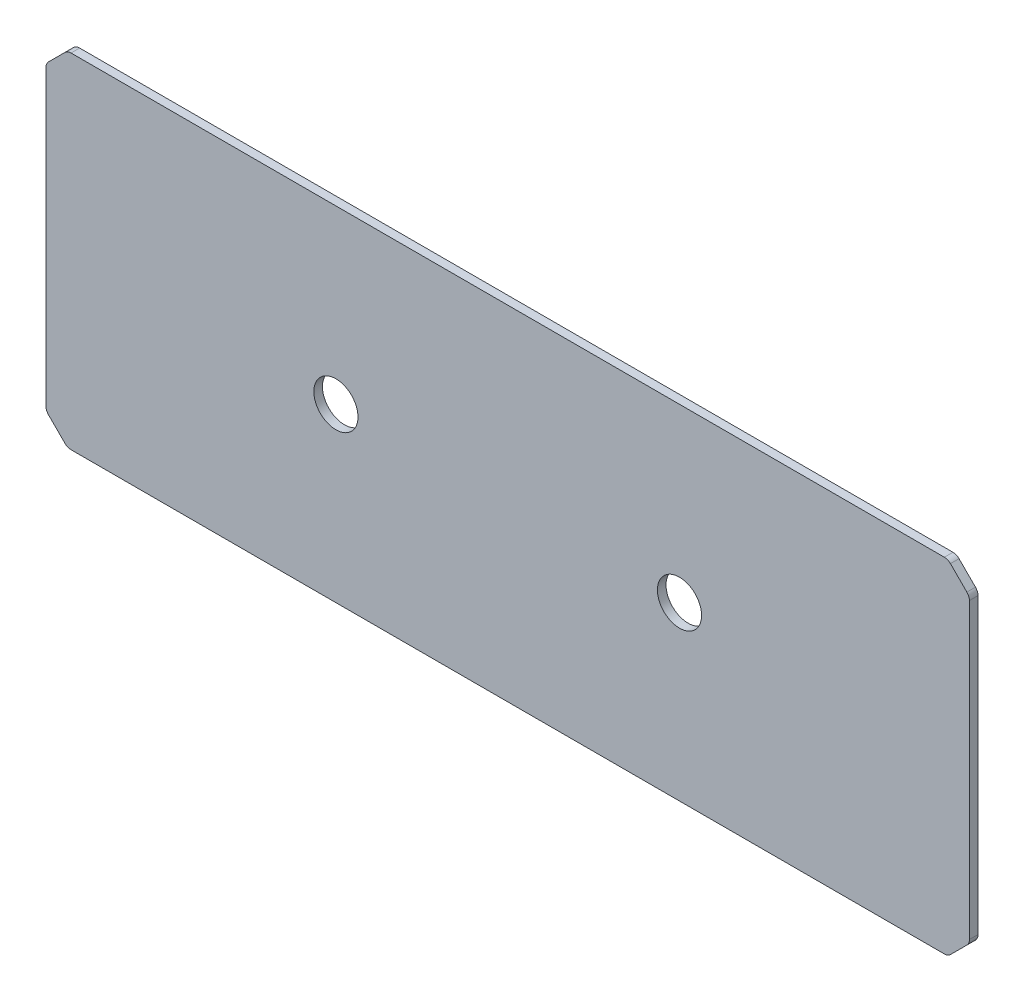
ISO-10303-21;
HEADER;
FILE_DESCRIPTION(('STEP AP214'),'2;1');
FILE_NAME('part.step','',(''),(''),'','','');
FILE_SCHEMA(('AUTOMOTIVE_DESIGN { 1 0 10303 214 1 1 1 1 }'));
ENDSEC;
DATA;
#1=APPLICATION_CONTEXT('core data for automotive mechanical design processes');
#2=APPLICATION_PROTOCOL_DEFINITION('international standard','automotive_design',2000,#1);
#3=PRODUCT_CONTEXT('',#1,'mechanical');
#4=PRODUCT('Part','Part','',(#3));
#5=PRODUCT_RELATED_PRODUCT_CATEGORY('part','',(#4));
#6=PRODUCT_DEFINITION_FORMATION('','',#4);
#7=PRODUCT_DEFINITION_CONTEXT('part definition',#1,'design');
#8=PRODUCT_DEFINITION('design','',#6,#7);
#9=PRODUCT_DEFINITION_SHAPE('','',#8);
#10=(LENGTH_UNIT() NAMED_UNIT(*) SI_UNIT(.MILLI.,.METRE.));
#11=(NAMED_UNIT(*) PLANE_ANGLE_UNIT() SI_UNIT($,.RADIAN.));
#12=(NAMED_UNIT(*) SI_UNIT($,.STERADIAN.) SOLID_ANGLE_UNIT());
#13=UNCERTAINTY_MEASURE_WITH_UNIT(LENGTH_MEASURE(1.E-05),#10,'distance_accuracy_value','');
#14=(GEOMETRIC_REPRESENTATION_CONTEXT(3) GLOBAL_UNCERTAINTY_ASSIGNED_CONTEXT((#13)) GLOBAL_UNIT_ASSIGNED_CONTEXT((#10,
#11,#12)) REPRESENTATION_CONTEXT('',''));
#15=CARTESIAN_POINT('',(0.,0.,0.));
#16=DIRECTION('',(0.,0.,1.));
#17=DIRECTION('',(1.,0.,0.));
#18=AXIS2_PLACEMENT_3D('',#15,#16,#17);
#19=CARTESIAN_POINT('',(0.,-88.046001815833,1.27));
#20=DIRECTION('',(-1.,0.,0.));
#21=DIRECTION('',(0.,0.,1.));
#22=AXIS2_PLACEMENT_3D('',#19,#20,#21);
#23=PLANE('',#22);
#24=DIRECTION('',(0.,1.,0.));
#25=VECTOR('',#24,1.);
#26=CARTESIAN_POINT('',(0.,-88.046001815833,1.27));
#27=LINE('',#26,#25);
#28=CARTESIAN_POINT('',(0.,3.70105122421385,1.27));
#29=VERTEX_POINT('',#28);
#30=CARTESIAN_POINT('',(0.,47.0989487757862,1.27));
#31=VERTEX_POINT('',#30);
#32=EDGE_CURVE('E316',#29,#31,#27,.T.);
#33=ORIENTED_EDGE('',*,*,#32,.T.);
#34=DIRECTION('',(0.,0.,1.));
#35=VECTOR('',#34,1.);
#36=CARTESIAN_POINT('',(0.,47.0989487757862,1.27));
#37=LINE('',#36,#35);
#38=CARTESIAN_POINT('',(0.,47.0989487757862,0.));
#39=VERTEX_POINT('',#38);
#40=EDGE_CURVE('E212',#31,#39,#37,.F.);
#41=ORIENTED_EDGE('',*,*,#40,.T.);
#42=DIRECTION('',(0.,1.,0.));
#43=VECTOR('',#42,1.);
#44=CARTESIAN_POINT('',(0.,-88.046001815833,0.));
#45=LINE('',#44,#43);
#46=CARTESIAN_POINT('',(0.,3.70105122421385,0.));
#47=VERTEX_POINT('',#46);
#48=EDGE_CURVE('E205',#47,#39,#45,.T.);
#49=ORIENTED_EDGE('',*,*,#48,.F.);
#50=DIRECTION('',(0.,0.,1.));
#51=VECTOR('',#50,1.);
#52=CARTESIAN_POINT('',(0.,3.70105122421385,1.27));
#53=LINE('',#52,#51);
#54=EDGE_CURVE('E218',#47,#29,#53,.T.);
#55=ORIENTED_EDGE('',*,*,#54,.T.);
#56=EDGE_LOOP('',(#33,#41,#49,#55));
#57=FACE_BOUND('',#56,.T.);
#58=ADVANCED_FACE('F86',(#57),#23,.T.);
#59=CARTESIAN_POINT('',(68.2625,-88.046001815833,0.));
#60=DIRECTION('',(0.,0.,1.));
#61=DIRECTION('',(1.,0.,0.));
#62=AXIS2_PLACEMENT_3D('',#59,#60,#61);
#63=PLANE('',#62);
#64=CARTESIAN_POINT('',(42.8625,25.4,0.));
#65=DIRECTION('',(0.,0.,1.));
#66=DIRECTION('',(1.,0.,0.));
#67=AXIS2_PLACEMENT_3D('',#64,#65,#66);
#68=CIRCLE('',#67,3.26389999999999);
#69=CARTESIAN_POINT('',(46.1264,25.4,0.));
#70=VERTEX_POINT('',#69);
#71=EDGE_CURVE('E385',#70,#70,#68,.T.);
#72=ORIENTED_EDGE('',*,*,#71,.T.);
#73=EDGE_LOOP('',(#72));
#74=FACE_BOUND('',#73,.T.);
#75=CARTESIAN_POINT('',(93.6625,25.4,0.));
#76=DIRECTION('',(0.,0.,1.));
#77=DIRECTION('',(1.,0.,0.));
#78=AXIS2_PLACEMENT_3D('',#75,#76,#77);
#79=CIRCLE('',#78,3.26389999999998);
#80=CARTESIAN_POINT('',(96.9264,25.4,0.));
#81=VERTEX_POINT('',#80);
#82=EDGE_CURVE('E308',#81,#81,#79,.T.);
#83=ORIENTED_EDGE('',*,*,#82,.T.);
#84=EDGE_LOOP('',(#83));
#85=FACE_BOUND('',#84,.T.);
#86=ORIENTED_EDGE('',*,*,#48,.T.);
#87=CARTESIAN_POINT('',(1.27,47.0989487757862,0.));
#88=DIRECTION('',(0.,0.,1.));
#89=DIRECTION('',(1.,0.,0.));
#90=AXIS2_PLACEMENT_3D('',#87,#88,#89);
#91=CIRCLE('',#90,1.27);
#92=CARTESIAN_POINT('',(0.3719743878931,47.9969743878932,0.));
#93=VERTEX_POINT('',#92);
#94=EDGE_CURVE('E244',#39,#93,#91,.F.);
#95=ORIENTED_EDGE('',*,*,#94,.T.);
#96=DIRECTION('',(-0.707106781186551,-0.707106781186544,0.));
#97=VECTOR('',#96,1.);
#98=CARTESIAN_POINT('',(0.,47.6250000000001,0.));
#99=LINE('',#98,#97);
#100=CARTESIAN_POINT('',(2.80302561210687,50.4280256121069,0.));
#101=VERTEX_POINT('',#100);
#102=EDGE_CURVE('E326',#93,#101,#99,.F.);
#103=ORIENTED_EDGE('',*,*,#102,.T.);
#104=CARTESIAN_POINT('',(3.70105122421378,49.53,0.));
#105=DIRECTION('',(0.,0.,1.));
#106=DIRECTION('',(1.,0.,0.));
#107=AXIS2_PLACEMENT_3D('',#104,#105,#106);
#108=CIRCLE('',#107,1.27);
#109=CARTESIAN_POINT('',(3.70105122421378,50.8,0.));
#110=VERTEX_POINT('',#109);
#111=EDGE_CURVE('E242',#101,#110,#108,.F.);
#112=ORIENTED_EDGE('',*,*,#111,.T.);
#113=DIRECTION('',(1.,0.,0.));
#114=VECTOR('',#113,1.);
#115=CARTESIAN_POINT('',(68.2625,50.8,0.));
#116=LINE('',#115,#114);
#117=CARTESIAN_POINT('',(132.823948775786,50.8,0.));
#118=VERTEX_POINT('',#117);
#119=EDGE_CURVE('E222',#110,#118,#116,.T.);
#120=ORIENTED_EDGE('',*,*,#119,.T.);
#121=CARTESIAN_POINT('',(132.823948775786,49.53,0.));
#122=DIRECTION('',(0.,0.,1.));
#123=DIRECTION('',(1.,0.,0.));
#124=AXIS2_PLACEMENT_3D('',#121,#122,#123);
#125=CIRCLE('',#124,1.27);
#126=CARTESIAN_POINT('',(133.721974387893,50.4280256121069,0.));
#127=VERTEX_POINT('',#126);
#128=EDGE_CURVE('E240',#118,#127,#125,.F.);
#129=ORIENTED_EDGE('',*,*,#128,.T.);
#130=DIRECTION('',(0.707106781186554,-0.707106781186541,0.));
#131=VECTOR('',#130,1.);
#132=CARTESIAN_POINT('',(133.35,50.8,0.));
#133=LINE('',#132,#131);
#134=CARTESIAN_POINT('',(136.153025612107,47.9969743878931,0.));
#135=VERTEX_POINT('',#134);
#136=EDGE_CURVE('E323',#127,#135,#133,.T.);
#137=ORIENTED_EDGE('',*,*,#136,.T.);
#138=CARTESIAN_POINT('',(135.255,47.0989487757862,0.));
#139=DIRECTION('',(0.,0.,1.));
#140=DIRECTION('',(1.,0.,0.));
#141=AXIS2_PLACEMENT_3D('',#138,#139,#140);
#142=CIRCLE('',#141,1.27);
#143=CARTESIAN_POINT('',(136.525,47.0989487757862,0.));
#144=VERTEX_POINT('',#143);
#145=EDGE_CURVE('E238',#135,#144,#142,.F.);
#146=ORIENTED_EDGE('',*,*,#145,.T.);
#147=DIRECTION('',(0.,1.,0.));
#148=VECTOR('',#147,1.);
#149=CARTESIAN_POINT('',(136.525,-88.046001815833,0.));
#150=LINE('',#149,#148);
#151=CARTESIAN_POINT('',(136.525,3.70105122421387,0.));
#152=VERTEX_POINT('',#151);
#153=EDGE_CURVE('E307',#152,#144,#150,.T.);
#154=ORIENTED_EDGE('',*,*,#153,.F.);
#155=CARTESIAN_POINT('',(135.255,3.70105122421387,0.));
#156=DIRECTION('',(0.,0.,1.));
#157=DIRECTION('',(1.,0.,0.));
#158=AXIS2_PLACEMENT_3D('',#155,#156,#157);
#159=CIRCLE('',#158,1.27);
#160=CARTESIAN_POINT('',(136.153025612107,2.80302561210695,0.));
#161=VERTEX_POINT('',#160);
#162=EDGE_CURVE('E236',#152,#161,#159,.F.);
#163=ORIENTED_EDGE('',*,*,#162,.T.);
#164=DIRECTION('',(0.707106781186549,0.707106781186546,0.));
#165=VECTOR('',#164,1.);
#166=CARTESIAN_POINT('',(136.525,3.17500000000003,0.));
#167=LINE('',#166,#165);
#168=CARTESIAN_POINT('',(133.721974387893,0.371974387893075,0.));
#169=VERTEX_POINT('',#168);
#170=EDGE_CURVE('E321',#161,#169,#167,.F.);
#171=ORIENTED_EDGE('',*,*,#170,.T.);
#172=CARTESIAN_POINT('',(132.823948775786,1.27,0.));
#173=DIRECTION('',(0.,0.,1.));
#174=DIRECTION('',(1.,0.,0.));
#175=AXIS2_PLACEMENT_3D('',#172,#173,#174);
#176=CIRCLE('',#175,1.27);
#177=CARTESIAN_POINT('',(132.823948775786,0.,0.));
#178=VERTEX_POINT('',#177);
#179=EDGE_CURVE('E234',#169,#178,#176,.F.);
#180=ORIENTED_EDGE('',*,*,#179,.T.);
#181=DIRECTION('',(1.,0.,0.));
#182=VECTOR('',#181,1.);
#183=CARTESIAN_POINT('',(68.2625,0.,0.));
#184=LINE('',#183,#182);
#185=CARTESIAN_POINT('',(3.70105122421385,0.,0.));
#186=VERTEX_POINT('',#185);
#187=EDGE_CURVE('E303',#186,#178,#184,.T.);
#188=ORIENTED_EDGE('',*,*,#187,.F.);
#189=CARTESIAN_POINT('',(3.70105122421385,1.27,0.));
#190=DIRECTION('',(0.,0.,1.));
#191=DIRECTION('',(1.,0.,0.));
#192=AXIS2_PLACEMENT_3D('',#189,#190,#191);
#193=CIRCLE('',#192,1.27);
#194=CARTESIAN_POINT('',(2.80302561210693,0.371974387893079,0.));
#195=VERTEX_POINT('',#194);
#196=EDGE_CURVE('E211',#186,#195,#193,.F.);
#197=ORIENTED_EDGE('',*,*,#196,.T.);
#198=DIRECTION('',(-0.707106781186548,0.707106781186548,0.));
#199=VECTOR('',#198,1.);
#200=CARTESIAN_POINT('',(3.17500000000001,0.,0.));
#201=LINE('',#200,#199);
#202=CARTESIAN_POINT('',(0.371974387893079,2.80302561210693,0.));
#203=VERTEX_POINT('',#202);
#204=EDGE_CURVE('E207',#195,#203,#201,.T.);
#205=ORIENTED_EDGE('',*,*,#204,.T.);
#206=CARTESIAN_POINT('',(1.27,3.70105122421385,0.));
#207=DIRECTION('',(0.,0.,1.));
#208=DIRECTION('',(1.,0.,0.));
#209=AXIS2_PLACEMENT_3D('',#206,#207,#208);
#210=CIRCLE('',#209,1.27);
#211=EDGE_CURVE('E202',#203,#47,#210,.F.);
#212=ORIENTED_EDGE('',*,*,#211,.T.);
#213=EDGE_LOOP('',(#86,#95,#103,#112,#120,#129,#137,#146,#154,#163,#171,#180,#188,#197,#205,#212));
#214=FACE_BOUND('',#213,.T.);
#215=ADVANCED_FACE('F204',(#74,#85,#214),#63,.F.);
#216=CARTESIAN_POINT('',(68.2625,50.8,1.27));
#217=DIRECTION('',(0.,1.,0.));
#218=DIRECTION('',(0.,0.,1.));
#219=AXIS2_PLACEMENT_3D('',#216,#217,#218);
#220=PLANE('',#219);
#221=ORIENTED_EDGE('',*,*,#119,.F.);
#222=DIRECTION('',(0.,0.,-1.));
#223=VECTOR('',#222,1.);
#224=CARTESIAN_POINT('',(3.70105122421378,50.8,1.27));
#225=LINE('',#224,#223);
#226=CARTESIAN_POINT('',(3.70105122421378,50.8,1.27));
#227=VERTEX_POINT('',#226);
#228=EDGE_CURVE('E266',#110,#227,#225,.F.);
#229=ORIENTED_EDGE('',*,*,#228,.T.);
#230=DIRECTION('',(1.,0.,0.));
#231=VECTOR('',#230,1.);
#232=CARTESIAN_POINT('',(68.2625,50.8,1.27));
#233=LINE('',#232,#231);
#234=CARTESIAN_POINT('',(132.823948775786,50.8,1.27));
#235=VERTEX_POINT('',#234);
#236=EDGE_CURVE('E348',#227,#235,#233,.T.);
#237=ORIENTED_EDGE('',*,*,#236,.T.);
#238=DIRECTION('',(0.,0.,-1.));
#239=VECTOR('',#238,1.);
#240=CARTESIAN_POINT('',(132.823948775786,50.8,1.27));
#241=LINE('',#240,#239);
#242=EDGE_CURVE('E263',#235,#118,#241,.T.);
#243=ORIENTED_EDGE('',*,*,#242,.T.);
#244=EDGE_LOOP('',(#221,#229,#237,#243));
#245=FACE_BOUND('',#244,.T.);
#246=ADVANCED_FACE('F346',(#245),#220,.T.);
#247=CARTESIAN_POINT('',(136.525,-88.046001815833,1.27));
#248=DIRECTION('',(-1.,0.,0.));
#249=DIRECTION('',(0.,0.,1.));
#250=AXIS2_PLACEMENT_3D('',#247,#248,#249);
#251=PLANE('',#250);
#252=ORIENTED_EDGE('',*,*,#153,.T.);
#253=DIRECTION('',(0.,0.,1.));
#254=VECTOR('',#253,1.);
#255=CARTESIAN_POINT('',(136.525,47.0989487757862,1.27));
#256=LINE('',#255,#254);
#257=CARTESIAN_POINT('',(136.525,47.0989487757862,1.27));
#258=VERTEX_POINT('',#257);
#259=EDGE_CURVE('E275',#144,#258,#256,.T.);
#260=ORIENTED_EDGE('',*,*,#259,.T.);
#261=DIRECTION('',(0.,1.,0.));
#262=VECTOR('',#261,1.);
#263=CARTESIAN_POINT('',(136.525,-88.046001815833,1.27));
#264=LINE('',#263,#262);
#265=CARTESIAN_POINT('',(136.525,3.70105122421387,1.27));
#266=VERTEX_POINT('',#265);
#267=EDGE_CURVE('E367',#266,#258,#264,.T.);
#268=ORIENTED_EDGE('',*,*,#267,.F.);
#269=DIRECTION('',(0.,0.,1.));
#270=VECTOR('',#269,1.);
#271=CARTESIAN_POINT('',(136.525,3.70105122421387,0.));
#272=LINE('',#271,#270);
#273=EDGE_CURVE('E272',#266,#152,#272,.F.);
#274=ORIENTED_EDGE('',*,*,#273,.T.);
#275=EDGE_LOOP('',(#252,#260,#268,#274));
#276=FACE_BOUND('',#275,.T.);
#277=ADVANCED_FACE('F363',(#276),#251,.F.);
#278=CARTESIAN_POINT('',(68.2625,0.,1.27));
#279=DIRECTION('',(0.,1.,0.));
#280=DIRECTION('',(0.,0.,1.));
#281=AXIS2_PLACEMENT_3D('',#278,#279,#280);
#282=PLANE('',#281);
#283=ORIENTED_EDGE('',*,*,#187,.T.);
#284=DIRECTION('',(0.,0.,-1.));
#285=VECTOR('',#284,1.);
#286=CARTESIAN_POINT('',(132.823948775786,0.,1.27));
#287=LINE('',#286,#285);
#288=CARTESIAN_POINT('',(132.823948775786,0.,1.27));
#289=VERTEX_POINT('',#288);
#290=EDGE_CURVE('E285',#178,#289,#287,.F.);
#291=ORIENTED_EDGE('',*,*,#290,.T.);
#292=DIRECTION('',(1.,0.,0.));
#293=VECTOR('',#292,1.);
#294=CARTESIAN_POINT('',(68.2625,0.,1.27));
#295=LINE('',#294,#293);
#296=CARTESIAN_POINT('',(3.70105122421385,0.,1.27));
#297=VERTEX_POINT('',#296);
#298=EDGE_CURVE('E221',#297,#289,#295,.T.);
#299=ORIENTED_EDGE('',*,*,#298,.F.);
#300=DIRECTION('',(0.,0.,-1.));
#301=VECTOR('',#300,1.);
#302=CARTESIAN_POINT('',(3.70105122421385,0.,0.));
#303=LINE('',#302,#301);
#304=EDGE_CURVE('E282',#297,#186,#303,.T.);
#305=ORIENTED_EDGE('',*,*,#304,.T.);
#306=EDGE_LOOP('',(#283,#291,#299,#305));
#307=FACE_BOUND('',#306,.T.);
#308=ADVANCED_FACE('F302',(#307),#282,.F.);
#309=CARTESIAN_POINT('',(68.2625,-88.046001815833,1.27));
#310=DIRECTION('',(0.,0.,1.));
#311=DIRECTION('',(1.,0.,0.));
#312=AXIS2_PLACEMENT_3D('',#309,#310,#311);
#313=PLANE('',#312);
#314=CARTESIAN_POINT('',(42.8625,25.4,1.27));
#315=DIRECTION('',(0.,0.,1.));
#316=DIRECTION('',(1.,0.,0.));
#317=AXIS2_PLACEMENT_3D('',#314,#315,#316);
#318=CIRCLE('',#317,3.26389999999999);
#319=CARTESIAN_POINT('',(46.1264,25.4,1.27));
#320=VERTEX_POINT('',#319);
#321=EDGE_CURVE('E383',#320,#320,#318,.T.);
#322=ORIENTED_EDGE('',*,*,#321,.F.);
#323=EDGE_LOOP('',(#322));
#324=FACE_BOUND('',#323,.T.);
#325=CARTESIAN_POINT('',(93.6625,25.4,1.27));
#326=DIRECTION('',(0.,0.,1.));
#327=DIRECTION('',(1.,0.,0.));
#328=AXIS2_PLACEMENT_3D('',#325,#326,#327);
#329=CIRCLE('',#328,3.26389999999998);
#330=CARTESIAN_POINT('',(96.9264,25.4,1.27));
#331=VERTEX_POINT('',#330);
#332=EDGE_CURVE('E313',#331,#331,#329,.T.);
#333=ORIENTED_EDGE('',*,*,#332,.F.);
#334=EDGE_LOOP('',(#333));
#335=FACE_BOUND('',#334,.T.);
#336=DIRECTION('',(0.707106781186551,0.707106781186544,0.));
#337=VECTOR('',#336,1.);
#338=CARTESIAN_POINT('',(-33.7042509079162,13.9207490920841,1.27));
#339=LINE('',#338,#337);
#340=CARTESIAN_POINT('',(2.80302561210686,50.4280256121069,1.27));
#341=VERTEX_POINT('',#340);
#342=CARTESIAN_POINT('',(0.371974387893083,47.9969743878932,1.27));
#343=VERTEX_POINT('',#342);
#344=EDGE_CURVE('E229',#341,#343,#339,.F.);
#345=ORIENTED_EDGE('',*,*,#344,.T.);
#346=CARTESIAN_POINT('',(1.27,47.0989487757862,1.27));
#347=DIRECTION('',(0.,0.,1.));
#348=DIRECTION('',(1.,0.,0.));
#349=AXIS2_PLACEMENT_3D('',#346,#347,#348);
#350=CIRCLE('',#349,1.27);
#351=EDGE_CURVE('E261',#343,#31,#350,.T.);
#352=ORIENTED_EDGE('',*,*,#351,.T.);
#353=ORIENTED_EDGE('',*,*,#32,.F.);
#354=CARTESIAN_POINT('',(1.27,3.70105122421385,1.27));
#355=DIRECTION('',(0.,0.,1.));
#356=DIRECTION('',(1.,0.,0.));
#357=AXIS2_PLACEMENT_3D('',#354,#355,#356);
#358=CIRCLE('',#357,1.27);
#359=CARTESIAN_POINT('',(0.371974387893062,2.80302561210694,1.27));
#360=VERTEX_POINT('',#359);
#361=EDGE_CURVE('E224',#29,#360,#358,.T.);
#362=ORIENTED_EDGE('',*,*,#361,.T.);
#363=DIRECTION('',(0.707106781186548,-0.707106781186548,0.));
#364=VECTOR('',#363,1.);
#365=CARTESIAN_POINT('',(79.7417509079165,-76.5667509079165,1.27));
#366=LINE('',#365,#364);
#367=CARTESIAN_POINT('',(2.80302561210691,0.37197438789309,1.27));
#368=VERTEX_POINT('',#367);
#369=EDGE_CURVE('E225',#360,#368,#366,.T.);
#370=ORIENTED_EDGE('',*,*,#369,.T.);
#371=CARTESIAN_POINT('',(3.70105122421385,1.27,1.27));
#372=DIRECTION('',(0.,0.,1.));
#373=DIRECTION('',(1.,0.,0.));
#374=AXIS2_PLACEMENT_3D('',#371,#372,#373);
#375=CIRCLE('',#374,1.27);
#376=EDGE_CURVE('E251',#368,#297,#375,.T.);
#377=ORIENTED_EDGE('',*,*,#376,.T.);
#378=ORIENTED_EDGE('',*,*,#298,.T.);
#379=CARTESIAN_POINT('',(132.823948775786,1.27,1.27));
#380=DIRECTION('',(0.,0.,1.));
#381=DIRECTION('',(1.,0.,0.));
#382=AXIS2_PLACEMENT_3D('',#379,#380,#381);
#383=CIRCLE('',#382,1.27);
#384=CARTESIAN_POINT('',(133.721974387893,0.371974387893076,1.27));
#385=VERTEX_POINT('',#384);
#386=EDGE_CURVE('E253',#289,#385,#383,.T.);
#387=ORIENTED_EDGE('',*,*,#386,.T.);
#388=DIRECTION('',(-0.707106781186549,-0.707106781186546,0.));
#389=VECTOR('',#388,1.);
#390=CARTESIAN_POINT('',(56.7832490920833,-76.5667509079163,1.27));
#391=LINE('',#390,#389);
#392=CARTESIAN_POINT('',(136.153025612107,2.80302561210695,1.27));
#393=VERTEX_POINT('',#392);
#394=EDGE_CURVE('E330',#385,#393,#391,.F.);
#395=ORIENTED_EDGE('',*,*,#394,.T.);
#396=CARTESIAN_POINT('',(135.255,3.70105122421387,1.27));
#397=DIRECTION('',(0.,0.,1.));
#398=DIRECTION('',(1.,0.,0.));
#399=AXIS2_PLACEMENT_3D('',#396,#397,#398);
#400=CIRCLE('',#399,1.27);
#401=EDGE_CURVE('E255',#393,#266,#400,.T.);
#402=ORIENTED_EDGE('',*,*,#401,.T.);
#403=ORIENTED_EDGE('',*,*,#267,.T.);
#404=CARTESIAN_POINT('',(135.255,47.0989487757862,1.27));
#405=DIRECTION('',(0.,0.,1.));
#406=DIRECTION('',(1.,0.,0.));
#407=AXIS2_PLACEMENT_3D('',#404,#405,#406);
#408=CIRCLE('',#407,1.27);
#409=CARTESIAN_POINT('',(136.153025612107,47.9969743878931,1.27));
#410=VERTEX_POINT('',#409);
#411=EDGE_CURVE('E257',#258,#410,#408,.T.);
#412=ORIENTED_EDGE('',*,*,#411,.T.);
#413=DIRECTION('',(-0.707106781186554,0.707106781186541,0.));
#414=VECTOR('',#413,1.);
#415=CARTESIAN_POINT('',(170.229250907916,13.9207490920847,1.27));
#416=LINE('',#415,#414);
#417=CARTESIAN_POINT('',(133.721974387893,50.4280256121069,1.27));
#418=VERTEX_POINT('',#417);
#419=EDGE_CURVE('E333',#410,#418,#416,.T.);
#420=ORIENTED_EDGE('',*,*,#419,.T.);
#421=CARTESIAN_POINT('',(132.823948775786,49.53,1.27));
#422=DIRECTION('',(0.,0.,1.));
#423=DIRECTION('',(1.,0.,0.));
#424=AXIS2_PLACEMENT_3D('',#421,#422,#423);
#425=CIRCLE('',#424,1.27);
#426=EDGE_CURVE('E101',#418,#235,#425,.T.);
#427=ORIENTED_EDGE('',*,*,#426,.T.);
#428=ORIENTED_EDGE('',*,*,#236,.F.);
#429=CARTESIAN_POINT('',(3.70105122421378,49.53,1.27));
#430=DIRECTION('',(0.,0.,1.));
#431=DIRECTION('',(1.,0.,0.));
#432=AXIS2_PLACEMENT_3D('',#429,#430,#431);
#433=CIRCLE('',#432,1.27);
#434=EDGE_CURVE('E109',#227,#341,#433,.T.);
#435=ORIENTED_EDGE('',*,*,#434,.T.);
#436=EDGE_LOOP('',(#345,#352,#353,#362,#370,#377,#378,#387,#395,#402,#403,#412,#420,#427,#428,#435));
#437=FACE_BOUND('',#436,.T.);
#438=ADVANCED_FACE('F293',(#324,#335,#437),#313,.T.);
#439=CARTESIAN_POINT('',(93.6625,25.4,0.));
#440=DIRECTION('',(0.,0.,1.));
#441=DIRECTION('',(1.,0.,0.));
#442=AXIS2_PLACEMENT_3D('',#439,#440,#441);
#443=CYLINDRICAL_SURFACE('',#442,3.26389999999998);
#444=ORIENTED_EDGE('',*,*,#82,.F.);
#445=EDGE_LOOP('',(#444));
#446=FACE_BOUND('',#445,.T.);
#447=ORIENTED_EDGE('',*,*,#332,.T.);
#448=EDGE_LOOP('',(#447));
#449=FACE_BOUND('',#448,.T.);
#450=ADVANCED_FACE('F395',(#446,#449),#443,.F.);
#451=CARTESIAN_POINT('',(42.8625,25.4,0.));
#452=DIRECTION('',(0.,0.,1.));
#453=DIRECTION('',(1.,0.,0.));
#454=AXIS2_PLACEMENT_3D('',#451,#452,#453);
#455=CYLINDRICAL_SURFACE('',#454,3.26389999999999);
#456=ORIENTED_EDGE('',*,*,#71,.F.);
#457=EDGE_LOOP('',(#456));
#458=FACE_BOUND('',#457,.T.);
#459=ORIENTED_EDGE('',*,*,#321,.T.);
#460=EDGE_LOOP('',(#459));
#461=FACE_BOUND('',#460,.T.);
#462=ADVANCED_FACE('F391',(#458,#461),#455,.F.);
#463=CARTESIAN_POINT('',(3.17500000000001,0.,1.27));
#464=DIRECTION('',(-0.707106781186548,-0.707106781186548,0.));
#465=DIRECTION('',(0.707106781186548,-0.707106781186548,0.));
#466=AXIS2_PLACEMENT_3D('',#463,#464,#465);
#467=PLANE('',#466);
#468=ORIENTED_EDGE('',*,*,#204,.F.);
#469=DIRECTION('',(0.,0.,-1.));
#470=VECTOR('',#469,1.);
#471=CARTESIAN_POINT('',(2.80302561210693,0.371974387893079,1.27));
#472=LINE('',#471,#470);
#473=EDGE_CURVE('E14',#195,#368,#472,.F.);
#474=ORIENTED_EDGE('',*,*,#473,.T.);
#475=ORIENTED_EDGE('',*,*,#369,.F.);
#476=DIRECTION('',(0.,0.,1.));
#477=VECTOR('',#476,1.);
#478=CARTESIAN_POINT('',(0.37197438789308,2.80302561210693,1.27));
#479=LINE('',#478,#477);
#480=EDGE_CURVE('E94',#360,#203,#479,.F.);
#481=ORIENTED_EDGE('',*,*,#480,.T.);
#482=EDGE_LOOP('',(#468,#474,#475,#481));
#483=FACE_BOUND('',#482,.T.);
#484=ADVANCED_FACE('F289',(#483),#467,.T.);
#485=CARTESIAN_POINT('',(0.,47.6250000000001,1.27));
#486=DIRECTION('',(0.707106781186544,-0.707106781186551,0.));
#487=DIRECTION('',(0.707106781186551,0.707106781186544,0.));
#488=AXIS2_PLACEMENT_3D('',#485,#486,#487);
#489=PLANE('',#488);
#490=ORIENTED_EDGE('',*,*,#102,.F.);
#491=DIRECTION('',(0.,0.,-1.));
#492=VECTOR('',#491,1.);
#493=CARTESIAN_POINT('',(0.371974387893099,47.9969743878932,1.27));
#494=LINE('',#493,#492);
#495=EDGE_CURVE('E248',#93,#343,#494,.F.);
#496=ORIENTED_EDGE('',*,*,#495,.T.);
#497=ORIENTED_EDGE('',*,*,#344,.F.);
#498=DIRECTION('',(0.,0.,1.));
#499=VECTOR('',#498,1.);
#500=CARTESIAN_POINT('',(2.80302561210687,50.4280256121069,1.27));
#501=LINE('',#500,#499);
#502=EDGE_CURVE('E246',#341,#101,#501,.F.);
#503=ORIENTED_EDGE('',*,*,#502,.T.);
#504=EDGE_LOOP('',(#490,#496,#497,#503));
#505=FACE_BOUND('',#504,.T.);
#506=ADVANCED_FACE('F342',(#505),#489,.F.);
#507=CARTESIAN_POINT('',(133.35,50.8,1.27));
#508=DIRECTION('',(0.707106781186541,0.707106781186554,0.));
#509=DIRECTION('',(-0.707106781186554,0.707106781186541,0.));
#510=AXIS2_PLACEMENT_3D('',#507,#508,#509);
#511=PLANE('',#510);
#512=ORIENTED_EDGE('',*,*,#136,.F.);
#513=DIRECTION('',(0.,0.,-1.));
#514=VECTOR('',#513,1.);
#515=CARTESIAN_POINT('',(133.721974387893,50.4280256121069,1.27));
#516=LINE('',#515,#514);
#517=EDGE_CURVE('E270',#127,#418,#516,.F.);
#518=ORIENTED_EDGE('',*,*,#517,.T.);
#519=ORIENTED_EDGE('',*,*,#419,.F.);
#520=DIRECTION('',(0.,0.,1.));
#521=VECTOR('',#520,1.);
#522=CARTESIAN_POINT('',(136.153025612107,47.9969743878931,0.));
#523=LINE('',#522,#521);
#524=EDGE_CURVE('E268',#410,#135,#523,.F.);
#525=ORIENTED_EDGE('',*,*,#524,.T.);
#526=EDGE_LOOP('',(#512,#518,#519,#525));
#527=FACE_BOUND('',#526,.T.);
#528=ADVANCED_FACE('F355',(#527),#511,.T.);
#529=CARTESIAN_POINT('',(136.525,3.17500000000003,1.27));
#530=DIRECTION('',(-0.707106781186546,0.707106781186549,0.));
#531=DIRECTION('',(-0.707106781186549,-0.707106781186546,0.));
#532=AXIS2_PLACEMENT_3D('',#529,#530,#531);
#533=PLANE('',#532);
#534=ORIENTED_EDGE('',*,*,#170,.F.);
#535=DIRECTION('',(0.,0.,-1.));
#536=VECTOR('',#535,1.);
#537=CARTESIAN_POINT('',(136.153025612107,2.80302561210695,1.27));
#538=LINE('',#537,#536);
#539=EDGE_CURVE('E280',#161,#393,#538,.F.);
#540=ORIENTED_EDGE('',*,*,#539,.T.);
#541=ORIENTED_EDGE('',*,*,#394,.F.);
#542=DIRECTION('',(0.,0.,1.));
#543=VECTOR('',#542,1.);
#544=CARTESIAN_POINT('',(133.721974387893,0.371974387893075,0.));
#545=LINE('',#544,#543);
#546=EDGE_CURVE('E278',#385,#169,#545,.F.);
#547=ORIENTED_EDGE('',*,*,#546,.T.);
#548=EDGE_LOOP('',(#534,#540,#541,#547));
#549=FACE_BOUND('',#548,.T.);
#550=ADVANCED_FACE('F374',(#549),#533,.F.);
#551=CARTESIAN_POINT('',(1.27,47.0989487757862,1.27));
#552=DIRECTION('',(0.,0.,1.));
#553=DIRECTION('',(1.,0.,0.));
#554=AXIS2_PLACEMENT_3D('',#551,#552,#553);
#555=CYLINDRICAL_SURFACE('',#554,1.27);
#556=ORIENTED_EDGE('',*,*,#351,.F.);
#557=ORIENTED_EDGE('',*,*,#495,.F.);
#558=ORIENTED_EDGE('',*,*,#94,.F.);
#559=ORIENTED_EDGE('',*,*,#40,.F.);
#560=EDGE_LOOP('',(#556,#557,#558,#559));
#561=FACE_BOUND('',#560,.T.);
#562=ADVANCED_FACE('F339',(#561),#555,.T.);
#563=CARTESIAN_POINT('',(3.70105122421378,49.53,1.27));
#564=DIRECTION('',(0.,0.,-1.));
#565=DIRECTION('',(-1.,0.,0.));
#566=AXIS2_PLACEMENT_3D('',#563,#564,#565);
#567=CYLINDRICAL_SURFACE('',#566,1.27);
#568=ORIENTED_EDGE('',*,*,#111,.F.);
#569=ORIENTED_EDGE('',*,*,#502,.F.);
#570=ORIENTED_EDGE('',*,*,#434,.F.);
#571=ORIENTED_EDGE('',*,*,#228,.F.);
#572=EDGE_LOOP('',(#568,#569,#570,#571));
#573=FACE_BOUND('',#572,.T.);
#574=ADVANCED_FACE('F343',(#573),#567,.T.);
#575=CARTESIAN_POINT('',(132.823948775786,49.53,1.27));
#576=DIRECTION('',(0.,0.,-1.));
#577=DIRECTION('',(-1.,0.,0.));
#578=AXIS2_PLACEMENT_3D('',#575,#576,#577);
#579=CYLINDRICAL_SURFACE('',#578,1.27);
#580=ORIENTED_EDGE('',*,*,#426,.F.);
#581=ORIENTED_EDGE('',*,*,#517,.F.);
#582=ORIENTED_EDGE('',*,*,#128,.F.);
#583=ORIENTED_EDGE('',*,*,#242,.F.);
#584=EDGE_LOOP('',(#580,#581,#582,#583));
#585=FACE_BOUND('',#584,.T.);
#586=ADVANCED_FACE('F350',(#585),#579,.T.);
#587=CARTESIAN_POINT('',(135.255,47.0989487757862,1.27));
#588=DIRECTION('',(0.,0.,-1.));
#589=DIRECTION('',(-1.,0.,0.));
#590=AXIS2_PLACEMENT_3D('',#587,#588,#589);
#591=CYLINDRICAL_SURFACE('',#590,1.27);
#592=ORIENTED_EDGE('',*,*,#145,.F.);
#593=ORIENTED_EDGE('',*,*,#524,.F.);
#594=ORIENTED_EDGE('',*,*,#411,.F.);
#595=ORIENTED_EDGE('',*,*,#259,.F.);
#596=EDGE_LOOP('',(#592,#593,#594,#595));
#597=FACE_BOUND('',#596,.T.);
#598=ADVANCED_FACE('F359',(#597),#591,.T.);
#599=CARTESIAN_POINT('',(135.255,3.70105122421387,1.27));
#600=DIRECTION('',(0.,0.,-1.));
#601=DIRECTION('',(-1.,0.,0.));
#602=AXIS2_PLACEMENT_3D('',#599,#600,#601);
#603=CYLINDRICAL_SURFACE('',#602,1.27);
#604=ORIENTED_EDGE('',*,*,#401,.F.);
#605=ORIENTED_EDGE('',*,*,#539,.F.);
#606=ORIENTED_EDGE('',*,*,#162,.F.);
#607=ORIENTED_EDGE('',*,*,#273,.F.);
#608=EDGE_LOOP('',(#604,#605,#606,#607));
#609=FACE_BOUND('',#608,.T.);
#610=ADVANCED_FACE('F370',(#609),#603,.T.);
#611=CARTESIAN_POINT('',(132.823948775786,1.27,1.27));
#612=DIRECTION('',(0.,0.,1.));
#613=DIRECTION('',(1.,0.,0.));
#614=AXIS2_PLACEMENT_3D('',#611,#612,#613);
#615=CYLINDRICAL_SURFACE('',#614,1.27);
#616=ORIENTED_EDGE('',*,*,#179,.F.);
#617=ORIENTED_EDGE('',*,*,#546,.F.);
#618=ORIENTED_EDGE('',*,*,#386,.F.);
#619=ORIENTED_EDGE('',*,*,#290,.F.);
#620=EDGE_LOOP('',(#616,#617,#618,#619));
#621=FACE_BOUND('',#620,.T.);
#622=ADVANCED_FACE('F378',(#621),#615,.T.);
#623=CARTESIAN_POINT('',(3.70105122421385,1.27,1.27));
#624=DIRECTION('',(0.,0.,1.));
#625=DIRECTION('',(1.,0.,0.));
#626=AXIS2_PLACEMENT_3D('',#623,#624,#625);
#627=CYLINDRICAL_SURFACE('',#626,1.27);
#628=ORIENTED_EDGE('',*,*,#376,.F.);
#629=ORIENTED_EDGE('',*,*,#473,.F.);
#630=ORIENTED_EDGE('',*,*,#196,.F.);
#631=ORIENTED_EDGE('',*,*,#304,.F.);
#632=EDGE_LOOP('',(#628,#629,#630,#631));
#633=FACE_BOUND('',#632,.T.);
#634=ADVANCED_FACE('F298',(#633),#627,.T.);
#635=CARTESIAN_POINT('',(1.27,3.70105122421385,1.27));
#636=DIRECTION('',(0.,0.,1.));
#637=DIRECTION('',(1.,0.,0.));
#638=AXIS2_PLACEMENT_3D('',#635,#636,#637);
#639=CYLINDRICAL_SURFACE('',#638,1.27);
#640=ORIENTED_EDGE('',*,*,#211,.F.);
#641=ORIENTED_EDGE('',*,*,#480,.F.);
#642=ORIENTED_EDGE('',*,*,#361,.F.);
#643=ORIENTED_EDGE('',*,*,#54,.F.);
#644=EDGE_LOOP('',(#640,#641,#642,#643));
#645=FACE_BOUND('',#644,.T.);
#646=ADVANCED_FACE('F88',(#645),#639,.T.);
#647=CLOSED_SHELL('',(#58,#215,#246,#277,#308,#438,#450,#462,#484,#506,#528,#550,#562,#574,#586,
#598,#610,#622,#634,#646));
#648=MANIFOLD_SOLID_BREP('B2',#647);
#649=ADVANCED_BREP_SHAPE_REPRESENTATION('',(#18,#648),#14);
#650=SHAPE_DEFINITION_REPRESENTATION(#9,#649);
ENDSEC;
END-ISO-10303-21;
